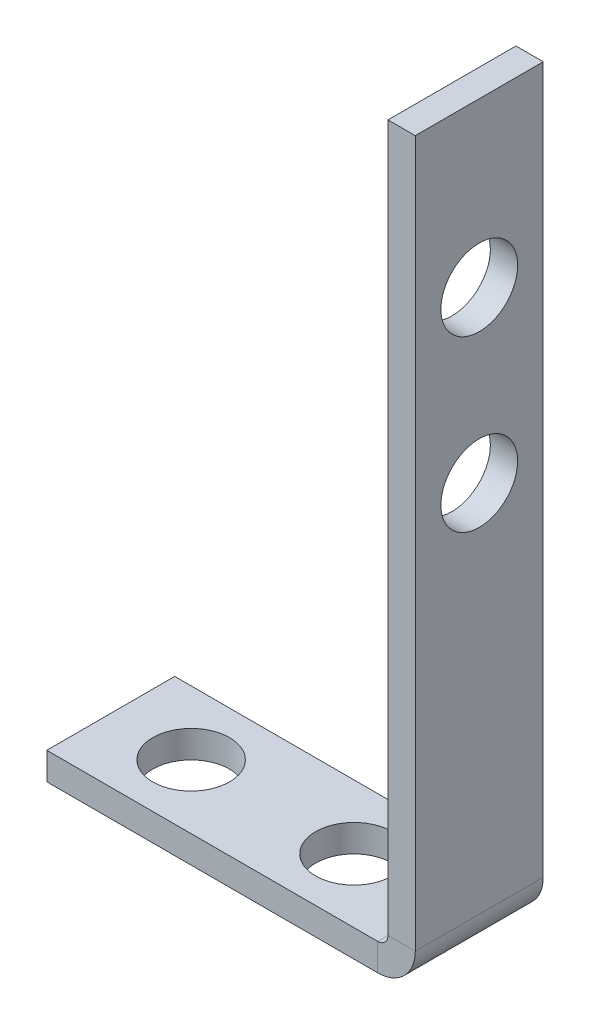
ISO-10303-21;
HEADER;
FILE_DESCRIPTION(('STEP AP214'),'2;1');
FILE_NAME('part.step','',(''),(''),'','','');
FILE_SCHEMA(('AUTOMOTIVE_DESIGN { 1 0 10303 214 1 1 1 1 }'));
ENDSEC;
DATA;
#1=APPLICATION_CONTEXT('core data for automotive mechanical design processes');
#2=APPLICATION_PROTOCOL_DEFINITION('international standard','automotive_design',2000,#1);
#3=PRODUCT_CONTEXT('',#1,'mechanical');
#4=PRODUCT('Part','Part','',(#3));
#5=PRODUCT_RELATED_PRODUCT_CATEGORY('part','',(#4));
#6=PRODUCT_DEFINITION_FORMATION('','',#4);
#7=PRODUCT_DEFINITION_CONTEXT('part definition',#1,'design');
#8=PRODUCT_DEFINITION('design','',#6,#7);
#9=PRODUCT_DEFINITION_SHAPE('','',#8);
#10=(LENGTH_UNIT() NAMED_UNIT(*) SI_UNIT(.MILLI.,.METRE.));
#11=(NAMED_UNIT(*) PLANE_ANGLE_UNIT() SI_UNIT($,.RADIAN.));
#12=(NAMED_UNIT(*) SI_UNIT($,.STERADIAN.) SOLID_ANGLE_UNIT());
#13=UNCERTAINTY_MEASURE_WITH_UNIT(LENGTH_MEASURE(1.E-05),#10,'distance_accuracy_value','');
#14=(GEOMETRIC_REPRESENTATION_CONTEXT(3) GLOBAL_UNCERTAINTY_ASSIGNED_CONTEXT((#13)) GLOBAL_UNIT_ASSIGNED_CONTEXT((#10,
#11,#12)) REPRESENTATION_CONTEXT('',''));
#15=CARTESIAN_POINT('',(0.,0.,0.));
#16=DIRECTION('',(0.,0.,1.));
#17=DIRECTION('',(1.,0.,0.));
#18=AXIS2_PLACEMENT_3D('',#15,#16,#17);
#19=CARTESIAN_POINT('',(0.,0.599999999999999,7.5));
#20=DIRECTION('',(0.,0.,1.));
#21=DIRECTION('',(1.,0.,0.));
#22=AXIS2_PLACEMENT_3D('',#19,#20,#21);
#23=PLANE('',#22);
#24=DIRECTION('',(1.,0.,0.));
#25=VECTOR('',#24,1.);
#26=CARTESIAN_POINT('',(0.,0.599999999999999,7.5));
#27=LINE('',#26,#25);
#28=CARTESIAN_POINT('',(0.,0.599999999999999,7.5));
#29=VERTEX_POINT('',#28);
#30=CARTESIAN_POINT('',(1.6,0.599999999999999,7.5));
#31=VERTEX_POINT('',#30);
#32=EDGE_CURVE('E11',#29,#31,#27,.T.);
#33=ORIENTED_EDGE('',*,*,#32,.F.);
#34=CARTESIAN_POINT('',(-0.6,0.6,7.5));
#35=DIRECTION('',(0.,0.,-1.));
#36=DIRECTION('',(-1.,0.,0.));
#37=AXIS2_PLACEMENT_3D('',#34,#35,#36);
#38=CIRCLE('',#37,0.6);
#39=CARTESIAN_POINT('',(-0.6,0.,7.5));
#40=VERTEX_POINT('',#39);
#41=EDGE_CURVE('E135',#40,#29,#38,.F.);
#42=ORIENTED_EDGE('',*,*,#41,.F.);
#43=DIRECTION('',(0.,1.,0.));
#44=VECTOR('',#43,1.);
#45=CARTESIAN_POINT('',(-0.6,-1.6,7.5));
#46=LINE('',#45,#44);
#47=CARTESIAN_POINT('',(-0.6,-1.6,7.5));
#48=VERTEX_POINT('',#47);
#49=EDGE_CURVE('E45',#48,#40,#46,.T.);
#50=ORIENTED_EDGE('',*,*,#49,.F.);
#51=CARTESIAN_POINT('',(-0.6,0.6,7.5));
#52=DIRECTION('',(0.,0.,1.));
#53=DIRECTION('',(1.,0.,0.));
#54=AXIS2_PLACEMENT_3D('',#51,#52,#53);
#55=CIRCLE('',#54,2.2);
#56=EDGE_CURVE('E128',#48,#31,#55,.T.);
#57=ORIENTED_EDGE('',*,*,#56,.T.);
#58=EDGE_LOOP('',(#33,#42,#50,#57));
#59=FACE_BOUND('',#58,.T.);
#60=ADVANCED_FACE('F36',(#59),#23,.T.);
#61=CARTESIAN_POINT('',(-0.6,-1.6,7.5));
#62=DIRECTION('',(0.,0.,1.));
#63=DIRECTION('',(1.,0.,0.));
#64=AXIS2_PLACEMENT_3D('',#61,#62,#63);
#65=PLANE('',#64);
#66=DIRECTION('',(0.,1.,0.));
#67=VECTOR('',#66,1.);
#68=CARTESIAN_POINT('',(0.,0.,7.5));
#69=LINE('',#68,#67);
#70=CARTESIAN_POINT('',(0.,42.,7.5));
#71=VERTEX_POINT('',#70);
#72=EDGE_CURVE('E204',#29,#71,#69,.T.);
#73=ORIENTED_EDGE('',*,*,#72,.F.);
#74=ORIENTED_EDGE('',*,*,#32,.T.);
#75=DIRECTION('',(0.,1.,0.));
#76=VECTOR('',#75,1.);
#77=CARTESIAN_POINT('',(1.6,0.,7.5));
#78=LINE('',#77,#76);
#79=CARTESIAN_POINT('',(1.6,42.,7.5));
#80=VERTEX_POINT('',#79);
#81=EDGE_CURVE('E94',#31,#80,#78,.T.);
#82=ORIENTED_EDGE('',*,*,#81,.T.);
#83=DIRECTION('',(1.,0.,0.));
#84=VECTOR('',#83,1.);
#85=CARTESIAN_POINT('',(0.,42.,7.5));
#86=LINE('',#85,#84);
#87=EDGE_CURVE('E201',#71,#80,#86,.T.);
#88=ORIENTED_EDGE('',*,*,#87,.F.);
#89=EDGE_LOOP('',(#73,#74,#82,#88));
#90=FACE_BOUND('',#89,.T.);
#91=ADVANCED_FACE('F224',(#90),#65,.T.);
#92=CARTESIAN_POINT('',(-0.6,0.,0.));
#93=DIRECTION('',(0.,0.,-1.));
#94=DIRECTION('',(-1.,0.,0.));
#95=AXIS2_PLACEMENT_3D('',#92,#93,#94);
#96=PLANE('',#95);
#97=DIRECTION('',(0.,-1.,0.));
#98=VECTOR('',#97,1.);
#99=CARTESIAN_POINT('',(-0.6,0.,0.));
#100=LINE('',#99,#98);
#101=CARTESIAN_POINT('',(-0.6,0.,0.));
#102=VERTEX_POINT('',#101);
#103=CARTESIAN_POINT('',(-0.6,-1.6,0.));
#104=VERTEX_POINT('',#103);
#105=EDGE_CURVE('E81',#102,#104,#100,.T.);
#106=ORIENTED_EDGE('',*,*,#105,.F.);
#107=CARTESIAN_POINT('',(-0.6,0.6,0.));
#108=DIRECTION('',(0.,0.,-1.));
#109=DIRECTION('',(-1.,0.,0.));
#110=AXIS2_PLACEMENT_3D('',#107,#108,#109);
#111=CIRCLE('',#110,0.6);
#112=CARTESIAN_POINT('',(0.,0.599999999999999,0.));
#113=VERTEX_POINT('',#112);
#114=EDGE_CURVE('E151',#102,#113,#111,.F.);
#115=ORIENTED_EDGE('',*,*,#114,.T.);
#116=DIRECTION('',(-1.,0.,0.));
#117=VECTOR('',#116,1.);
#118=CARTESIAN_POINT('',(1.6,0.599999999999999,0.));
#119=LINE('',#118,#117);
#120=CARTESIAN_POINT('',(1.6,0.599999999999999,0.));
#121=VERTEX_POINT('',#120);
#122=EDGE_CURVE('E88',#121,#113,#119,.T.);
#123=ORIENTED_EDGE('',*,*,#122,.F.);
#124=CARTESIAN_POINT('',(-0.6,0.6,0.));
#125=DIRECTION('',(0.,0.,1.));
#126=DIRECTION('',(1.,0.,0.));
#127=AXIS2_PLACEMENT_3D('',#124,#125,#126);
#128=CIRCLE('',#127,2.2);
#129=EDGE_CURVE('E158',#104,#121,#128,.T.);
#130=ORIENTED_EDGE('',*,*,#129,.F.);
#131=EDGE_LOOP('',(#106,#115,#123,#130));
#132=FACE_BOUND('',#131,.T.);
#133=ADVANCED_FACE('F222',(#132),#96,.T.);
#134=CARTESIAN_POINT('',(1.6,0.599999999999999,0.));
#135=DIRECTION('',(0.,0.,-1.));
#136=DIRECTION('',(-1.,0.,0.));
#137=AXIS2_PLACEMENT_3D('',#134,#135,#136);
#138=PLANE('',#137);
#139=DIRECTION('',(1.,0.,0.));
#140=VECTOR('',#139,1.);
#141=CARTESIAN_POINT('',(-20.,0.,0.));
#142=LINE('',#141,#140);
#143=CARTESIAN_POINT('',(-20.,0.,0.));
#144=VERTEX_POINT('',#143);
#145=EDGE_CURVE('E153',#144,#102,#142,.T.);
#146=ORIENTED_EDGE('',*,*,#145,.T.);
#147=ORIENTED_EDGE('',*,*,#105,.T.);
#148=DIRECTION('',(1.,0.,0.));
#149=VECTOR('',#148,1.);
#150=CARTESIAN_POINT('',(-20.,-1.6,0.));
#151=LINE('',#150,#149);
#152=CARTESIAN_POINT('',(-20.,-1.6,0.));
#153=VERTEX_POINT('',#152);
#154=EDGE_CURVE('E156',#153,#104,#151,.T.);
#155=ORIENTED_EDGE('',*,*,#154,.F.);
#156=DIRECTION('',(0.,1.,0.));
#157=VECTOR('',#156,1.);
#158=CARTESIAN_POINT('',(-20.,-1.6,0.));
#159=LINE('',#158,#157);
#160=EDGE_CURVE('E116',#153,#144,#159,.T.);
#161=ORIENTED_EDGE('',*,*,#160,.T.);
#162=EDGE_LOOP('',(#146,#147,#155,#161));
#163=FACE_BOUND('',#162,.T.);
#164=ADVANCED_FACE('F218',(#163),#138,.T.);
#165=CARTESIAN_POINT('',(1.6,0.,7.5));
#166=DIRECTION('',(-1.,0.,0.));
#167=DIRECTION('',(0.,0.,1.));
#168=AXIS2_PLACEMENT_3D('',#165,#166,#167);
#169=PLANE('',#168);
#170=CARTESIAN_POINT('',(1.6,22.49,3.75));
#171=DIRECTION('',(1.,0.,0.));
#172=DIRECTION('',(0.,0.,-1.));
#173=AXIS2_PLACEMENT_3D('',#170,#171,#172);
#174=CIRCLE('',#173,2.25);
#175=CARTESIAN_POINT('',(1.6,22.49,1.5));
#176=VERTEX_POINT('',#175);
#177=EDGE_CURVE('E182',#176,#176,#174,.T.);
#178=ORIENTED_EDGE('',*,*,#177,.F.);
#179=EDGE_LOOP('',(#178));
#180=FACE_BOUND('',#179,.T.);
#181=CARTESIAN_POINT('',(1.6,32.425,3.75));
#182=DIRECTION('',(1.,0.,0.));
#183=DIRECTION('',(0.,0.,-1.));
#184=AXIS2_PLACEMENT_3D('',#181,#182,#183);
#185=CIRCLE('',#184,2.25);
#186=CARTESIAN_POINT('',(1.6,32.425,1.5));
#187=VERTEX_POINT('',#186);
#188=EDGE_CURVE('E179',#187,#187,#185,.T.);
#189=ORIENTED_EDGE('',*,*,#188,.F.);
#190=EDGE_LOOP('',(#189));
#191=FACE_BOUND('',#190,.T.);
#192=DIRECTION('',(0.,1.,0.));
#193=VECTOR('',#192,1.);
#194=CARTESIAN_POINT('',(1.6,0.,0.));
#195=LINE('',#194,#193);
#196=CARTESIAN_POINT('',(1.6,42.,0.));
#197=VERTEX_POINT('',#196);
#198=EDGE_CURVE('E141',#121,#197,#195,.T.);
#199=ORIENTED_EDGE('',*,*,#198,.T.);
#200=DIRECTION('',(0.,0.,-1.));
#201=VECTOR('',#200,1.);
#202=CARTESIAN_POINT('',(1.6,42.,7.5));
#203=LINE('',#202,#201);
#204=EDGE_CURVE('E172',#80,#197,#203,.T.);
#205=ORIENTED_EDGE('',*,*,#204,.F.);
#206=ORIENTED_EDGE('',*,*,#81,.F.);
#207=DIRECTION('',(0.,0.,-1.));
#208=VECTOR('',#207,1.);
#209=CARTESIAN_POINT('',(1.6,0.599999999999999,7.5));
#210=LINE('',#209,#208);
#211=EDGE_CURVE('E140',#31,#121,#210,.T.);
#212=ORIENTED_EDGE('',*,*,#211,.T.);
#213=EDGE_LOOP('',(#199,#205,#206,#212));
#214=FACE_BOUND('',#213,.T.);
#215=ADVANCED_FACE('F230',(#180,#191,#214),#169,.F.);
#216=CARTESIAN_POINT('',(0.,42.,7.5));
#217=DIRECTION('',(0.,1.,0.));
#218=DIRECTION('',(-1.,0.,0.));
#219=AXIS2_PLACEMENT_3D('',#216,#217,#218);
#220=PLANE('',#219);
#221=DIRECTION('',(1.,0.,0.));
#222=VECTOR('',#221,1.);
#223=CARTESIAN_POINT('',(0.,42.,0.));
#224=LINE('',#223,#222);
#225=CARTESIAN_POINT('',(0.,42.,0.));
#226=VERTEX_POINT('',#225);
#227=EDGE_CURVE('E144',#226,#197,#224,.T.);
#228=ORIENTED_EDGE('',*,*,#227,.F.);
#229=DIRECTION('',(0.,0.,-1.));
#230=VECTOR('',#229,1.);
#231=CARTESIAN_POINT('',(0.,42.,7.5));
#232=LINE('',#231,#230);
#233=EDGE_CURVE('E170',#71,#226,#232,.T.);
#234=ORIENTED_EDGE('',*,*,#233,.F.);
#235=ORIENTED_EDGE('',*,*,#87,.T.);
#236=ORIENTED_EDGE('',*,*,#204,.T.);
#237=EDGE_LOOP('',(#228,#234,#235,#236));
#238=FACE_BOUND('',#237,.T.);
#239=ADVANCED_FACE('F259',(#238),#220,.T.);
#240=CARTESIAN_POINT('',(0.,0.,7.5));
#241=DIRECTION('',(-1.,0.,0.));
#242=DIRECTION('',(0.,0.,1.));
#243=AXIS2_PLACEMENT_3D('',#240,#241,#242);
#244=PLANE('',#243);
#245=CARTESIAN_POINT('',(0.,22.49,3.75));
#246=DIRECTION('',(-1.,0.,0.));
#247=DIRECTION('',(0.,0.,1.));
#248=AXIS2_PLACEMENT_3D('',#245,#246,#247);
#249=CIRCLE('',#248,2.25);
#250=CARTESIAN_POINT('',(0.,22.49,6.00000000000001));
#251=VERTEX_POINT('',#250);
#252=EDGE_CURVE('E180',#251,#251,#249,.T.);
#253=ORIENTED_EDGE('',*,*,#252,.F.);
#254=EDGE_LOOP('',(#253));
#255=FACE_BOUND('',#254,.T.);
#256=CARTESIAN_POINT('',(0.,32.425,3.75));
#257=DIRECTION('',(-1.,0.,0.));
#258=DIRECTION('',(0.,0.,1.));
#259=AXIS2_PLACEMENT_3D('',#256,#257,#258);
#260=CIRCLE('',#259,2.25);
#261=CARTESIAN_POINT('',(0.,32.425,6.00000000000001));
#262=VERTEX_POINT('',#261);
#263=EDGE_CURVE('E145',#262,#262,#260,.T.);
#264=ORIENTED_EDGE('',*,*,#263,.F.);
#265=EDGE_LOOP('',(#264));
#266=FACE_BOUND('',#265,.T.);
#267=DIRECTION('',(0.,1.,0.));
#268=VECTOR('',#267,1.);
#269=CARTESIAN_POINT('',(0.,0.,0.));
#270=LINE('',#269,#268);
#271=EDGE_CURVE('E148',#113,#226,#270,.T.);
#272=ORIENTED_EDGE('',*,*,#271,.F.);
#273=DIRECTION('',(0.,0.,-1.));
#274=VECTOR('',#273,1.);
#275=CARTESIAN_POINT('',(0.,0.599999999999999,7.5));
#276=LINE('',#275,#274);
#277=EDGE_CURVE('E167',#29,#113,#276,.T.);
#278=ORIENTED_EDGE('',*,*,#277,.F.);
#279=ORIENTED_EDGE('',*,*,#72,.T.);
#280=ORIENTED_EDGE('',*,*,#233,.T.);
#281=EDGE_LOOP('',(#272,#278,#279,#280));
#282=FACE_BOUND('',#281,.T.);
#283=ADVANCED_FACE('F264',(#255,#266,#282),#244,.T.);
#284=CARTESIAN_POINT('',(-0.6,0.6,7.5));
#285=DIRECTION('',(0.,0.,-1.));
#286=DIRECTION('',(-1.,0.,0.));
#287=AXIS2_PLACEMENT_3D('',#284,#285,#286);
#288=CYLINDRICAL_SURFACE('',#287,0.6);
#289=ORIENTED_EDGE('',*,*,#114,.F.);
#290=DIRECTION('',(0.,0.,-1.));
#291=VECTOR('',#290,1.);
#292=CARTESIAN_POINT('',(-0.6,0.,7.5));
#293=LINE('',#292,#291);
#294=EDGE_CURVE('E164',#40,#102,#293,.T.);
#295=ORIENTED_EDGE('',*,*,#294,.F.);
#296=ORIENTED_EDGE('',*,*,#41,.T.);
#297=ORIENTED_EDGE('',*,*,#277,.T.);
#298=EDGE_LOOP('',(#289,#295,#296,#297));
#299=FACE_BOUND('',#298,.T.);
#300=ADVANCED_FACE('F211',(#299),#288,.F.);
#301=CARTESIAN_POINT('',(-20.,0.,7.5));
#302=DIRECTION('',(0.,1.,0.));
#303=DIRECTION('',(0.,0.,1.));
#304=AXIS2_PLACEMENT_3D('',#301,#302,#303);
#305=PLANE('',#304);
#306=CARTESIAN_POINT('',(-5.74354080573928,0.,3.75000000000014));
#307=DIRECTION('',(0.,1.,0.));
#308=DIRECTION('',(0.,0.,1.));
#309=AXIS2_PLACEMENT_3D('',#306,#307,#308);
#310=CIRCLE('',#309,2.25);
#311=CARTESIAN_POINT('',(-5.74354080573928,0.,6.00000000000014));
#312=VERTEX_POINT('',#311);
#313=EDGE_CURVE('E195',#312,#312,#310,.T.);
#314=ORIENTED_EDGE('',*,*,#313,.F.);
#315=EDGE_LOOP('',(#314));
#316=FACE_BOUND('',#315,.T.);
#317=CARTESIAN_POINT('',(-15.2884418834684,0.,3.75000000000014));
#318=DIRECTION('',(0.,1.,0.));
#319=DIRECTION('',(0.,0.,1.));
#320=AXIS2_PLACEMENT_3D('',#317,#318,#319);
#321=CIRCLE('',#320,2.25);
#322=CARTESIAN_POINT('',(-15.2884418834684,0.,6.00000000000014));
#323=VERTEX_POINT('',#322);
#324=EDGE_CURVE('E185',#323,#323,#321,.T.);
#325=ORIENTED_EDGE('',*,*,#324,.F.);
#326=EDGE_LOOP('',(#325));
#327=FACE_BOUND('',#326,.T.);
#328=ORIENTED_EDGE('',*,*,#145,.F.);
#329=DIRECTION('',(0.,0.,-1.));
#330=VECTOR('',#329,1.);
#331=CARTESIAN_POINT('',(-20.,0.,7.5));
#332=LINE('',#331,#330);
#333=CARTESIAN_POINT('',(-20.,0.,7.5));
#334=VERTEX_POINT('',#333);
#335=EDGE_CURVE('E118',#334,#144,#332,.T.);
#336=ORIENTED_EDGE('',*,*,#335,.F.);
#337=DIRECTION('',(1.,0.,0.));
#338=VECTOR('',#337,1.);
#339=CARTESIAN_POINT('',(-20.,0.,7.5));
#340=LINE('',#339,#338);
#341=EDGE_CURVE('E133',#334,#40,#340,.T.);
#342=ORIENTED_EDGE('',*,*,#341,.T.);
#343=ORIENTED_EDGE('',*,*,#294,.T.);
#344=EDGE_LOOP('',(#328,#336,#342,#343));
#345=FACE_BOUND('',#344,.T.);
#346=ADVANCED_FACE('F217',(#316,#327,#345),#305,.T.);
#347=CARTESIAN_POINT('',(-20.,-1.6,7.5));
#348=DIRECTION('',(-1.,0.,0.));
#349=DIRECTION('',(0.,0.,1.));
#350=AXIS2_PLACEMENT_3D('',#347,#348,#349);
#351=PLANE('',#350);
#352=ORIENTED_EDGE('',*,*,#160,.F.);
#353=DIRECTION('',(0.,0.,-1.));
#354=VECTOR('',#353,1.);
#355=CARTESIAN_POINT('',(-20.,-1.6,7.5));
#356=LINE('',#355,#354);
#357=CARTESIAN_POINT('',(-20.,-1.6,7.5));
#358=VERTEX_POINT('',#357);
#359=EDGE_CURVE('E110',#358,#153,#356,.T.);
#360=ORIENTED_EDGE('',*,*,#359,.F.);
#361=DIRECTION('',(0.,1.,0.));
#362=VECTOR('',#361,1.);
#363=CARTESIAN_POINT('',(-20.,-1.6,7.5));
#364=LINE('',#363,#362);
#365=EDGE_CURVE('E114',#358,#334,#364,.T.);
#366=ORIENTED_EDGE('',*,*,#365,.T.);
#367=ORIENTED_EDGE('',*,*,#335,.T.);
#368=EDGE_LOOP('',(#352,#360,#366,#367));
#369=FACE_BOUND('',#368,.T.);
#370=ADVANCED_FACE('F112',(#369),#351,.T.);
#371=CARTESIAN_POINT('',(-20.,-1.6,7.5));
#372=DIRECTION('',(0.,1.,0.));
#373=DIRECTION('',(0.,0.,1.));
#374=AXIS2_PLACEMENT_3D('',#371,#372,#373);
#375=PLANE('',#374);
#376=CARTESIAN_POINT('',(-5.74354080573928,-1.6,3.75000000000014));
#377=DIRECTION('',(0.,1.,0.));
#378=DIRECTION('',(0.,0.,1.));
#379=AXIS2_PLACEMENT_3D('',#376,#377,#378);
#380=CIRCLE('',#379,2.25);
#381=CARTESIAN_POINT('',(-5.74354080573928,-1.6,6.00000000000014));
#382=VERTEX_POINT('',#381);
#383=EDGE_CURVE('E39',#382,#382,#380,.T.);
#384=ORIENTED_EDGE('',*,*,#383,.T.);
#385=EDGE_LOOP('',(#384));
#386=FACE_BOUND('',#385,.T.);
#387=CARTESIAN_POINT('',(-15.2884418834684,-1.6,3.75000000000014));
#388=DIRECTION('',(0.,1.,0.));
#389=DIRECTION('',(0.,0.,1.));
#390=AXIS2_PLACEMENT_3D('',#387,#388,#389);
#391=CIRCLE('',#390,2.25);
#392=CARTESIAN_POINT('',(-15.2884418834684,-1.6,6.00000000000014));
#393=VERTEX_POINT('',#392);
#394=EDGE_CURVE('E183',#393,#393,#391,.T.);
#395=ORIENTED_EDGE('',*,*,#394,.T.);
#396=EDGE_LOOP('',(#395));
#397=FACE_BOUND('',#396,.T.);
#398=ORIENTED_EDGE('',*,*,#154,.T.);
#399=DIRECTION('',(0.,0.,-1.));
#400=VECTOR('',#399,1.);
#401=CARTESIAN_POINT('',(-0.6,-1.6,7.5));
#402=LINE('',#401,#400);
#403=EDGE_CURVE('E119',#48,#104,#402,.T.);
#404=ORIENTED_EDGE('',*,*,#403,.F.);
#405=DIRECTION('',(1.,0.,0.));
#406=VECTOR('',#405,1.);
#407=CARTESIAN_POINT('',(-20.,-1.6,7.5));
#408=LINE('',#407,#406);
#409=EDGE_CURVE('E123',#358,#48,#408,.T.);
#410=ORIENTED_EDGE('',*,*,#409,.F.);
#411=ORIENTED_EDGE('',*,*,#359,.T.);
#412=EDGE_LOOP('',(#398,#404,#410,#411));
#413=FACE_BOUND('',#412,.T.);
#414=ADVANCED_FACE('F124',(#386,#397,#413),#375,.F.);
#415=CARTESIAN_POINT('',(-0.6,0.6,7.5));
#416=DIRECTION('',(0.,0.,-1.));
#417=DIRECTION('',(-1.,0.,0.));
#418=AXIS2_PLACEMENT_3D('',#415,#416,#417);
#419=CYLINDRICAL_SURFACE('',#418,2.2);
#420=ORIENTED_EDGE('',*,*,#129,.T.);
#421=ORIENTED_EDGE('',*,*,#211,.F.);
#422=ORIENTED_EDGE('',*,*,#56,.F.);
#423=ORIENTED_EDGE('',*,*,#403,.T.);
#424=EDGE_LOOP('',(#420,#421,#422,#423));
#425=FACE_BOUND('',#424,.T.);
#426=ADVANCED_FACE('F220',(#425),#419,.T.);
#427=CARTESIAN_POINT('',(-0.6,0.6,7.5));
#428=DIRECTION('',(0.,0.,-1.));
#429=DIRECTION('',(-1.,0.,0.));
#430=AXIS2_PLACEMENT_3D('',#427,#428,#429);
#431=PLANE('',#430);
#432=ORIENTED_EDGE('',*,*,#409,.T.);
#433=ORIENTED_EDGE('',*,*,#49,.T.);
#434=ORIENTED_EDGE('',*,*,#341,.F.);
#435=ORIENTED_EDGE('',*,*,#365,.F.);
#436=EDGE_LOOP('',(#432,#433,#434,#435));
#437=FACE_BOUND('',#436,.T.);
#438=ADVANCED_FACE('F131',(#437),#431,.F.);
#439=CARTESIAN_POINT('',(-0.6,0.6,0.));
#440=DIRECTION('',(0.,0.,-1.));
#441=DIRECTION('',(-1.,0.,0.));
#442=AXIS2_PLACEMENT_3D('',#439,#440,#441);
#443=PLANE('',#442);
#444=ORIENTED_EDGE('',*,*,#198,.F.);
#445=ORIENTED_EDGE('',*,*,#122,.T.);
#446=ORIENTED_EDGE('',*,*,#271,.T.);
#447=ORIENTED_EDGE('',*,*,#227,.T.);
#448=EDGE_LOOP('',(#444,#445,#446,#447));
#449=FACE_BOUND('',#448,.T.);
#450=ADVANCED_FACE('F308',(#449),#443,.T.);
#451=CARTESIAN_POINT('',(-8.4,32.425,3.75));
#452=DIRECTION('',(1.,0.,0.));
#453=DIRECTION('',(0.,0.,-1.));
#454=AXIS2_PLACEMENT_3D('',#451,#452,#453);
#455=CYLINDRICAL_SURFACE('',#454,2.25);
#456=ORIENTED_EDGE('',*,*,#263,.T.);
#457=EDGE_LOOP('',(#456));
#458=FACE_BOUND('',#457,.T.);
#459=ORIENTED_EDGE('',*,*,#188,.T.);
#460=EDGE_LOOP('',(#459));
#461=FACE_BOUND('',#460,.T.);
#462=ADVANCED_FACE('F318',(#458,#461),#455,.F.);
#463=CARTESIAN_POINT('',(-8.4,22.49,3.75));
#464=DIRECTION('',(1.,0.,0.));
#465=DIRECTION('',(0.,0.,-1.));
#466=AXIS2_PLACEMENT_3D('',#463,#464,#465);
#467=CYLINDRICAL_SURFACE('',#466,2.25);
#468=ORIENTED_EDGE('',*,*,#252,.T.);
#469=EDGE_LOOP('',(#468));
#470=FACE_BOUND('',#469,.T.);
#471=ORIENTED_EDGE('',*,*,#177,.T.);
#472=EDGE_LOOP('',(#471));
#473=FACE_BOUND('',#472,.T.);
#474=ADVANCED_FACE('F345',(#470,#473),#467,.F.);
#475=CARTESIAN_POINT('',(-15.2884418834684,-10.,3.75000000000014));
#476=DIRECTION('',(0.,1.,0.));
#477=DIRECTION('',(0.,0.,1.));
#478=AXIS2_PLACEMENT_3D('',#475,#476,#477);
#479=CYLINDRICAL_SURFACE('',#478,2.25);
#480=ORIENTED_EDGE('',*,*,#324,.T.);
#481=EDGE_LOOP('',(#480));
#482=FACE_BOUND('',#481,.T.);
#483=ORIENTED_EDGE('',*,*,#394,.F.);
#484=EDGE_LOOP('',(#483));
#485=FACE_BOUND('',#484,.T.);
#486=ADVANCED_FACE('F356',(#482,#485),#479,.F.);
#487=CARTESIAN_POINT('',(-5.74354080573928,-10.,3.75000000000014));
#488=DIRECTION('',(0.,1.,0.));
#489=DIRECTION('',(0.,0.,1.));
#490=AXIS2_PLACEMENT_3D('',#487,#488,#489);
#491=CYLINDRICAL_SURFACE('',#490,2.25);
#492=ORIENTED_EDGE('',*,*,#313,.T.);
#493=EDGE_LOOP('',(#492));
#494=FACE_BOUND('',#493,.T.);
#495=ORIENTED_EDGE('',*,*,#383,.F.);
#496=EDGE_LOOP('',(#495));
#497=FACE_BOUND('',#496,.T.);
#498=ADVANCED_FACE('F383',(#494,#497),#491,.F.);
#499=CLOSED_SHELL('',(#60,#91,#133,#164,#215,#239,#283,#300,#346,#370,#414,#426,#438,#450,#462,
#474,#486,#498));
#500=MANIFOLD_SOLID_BREP('B2',#499);
#501=ADVANCED_BREP_SHAPE_REPRESENTATION('',(#18,#500),#14);
#502=SHAPE_DEFINITION_REPRESENTATION(#9,#501);
ENDSEC;
END-ISO-10303-21;
